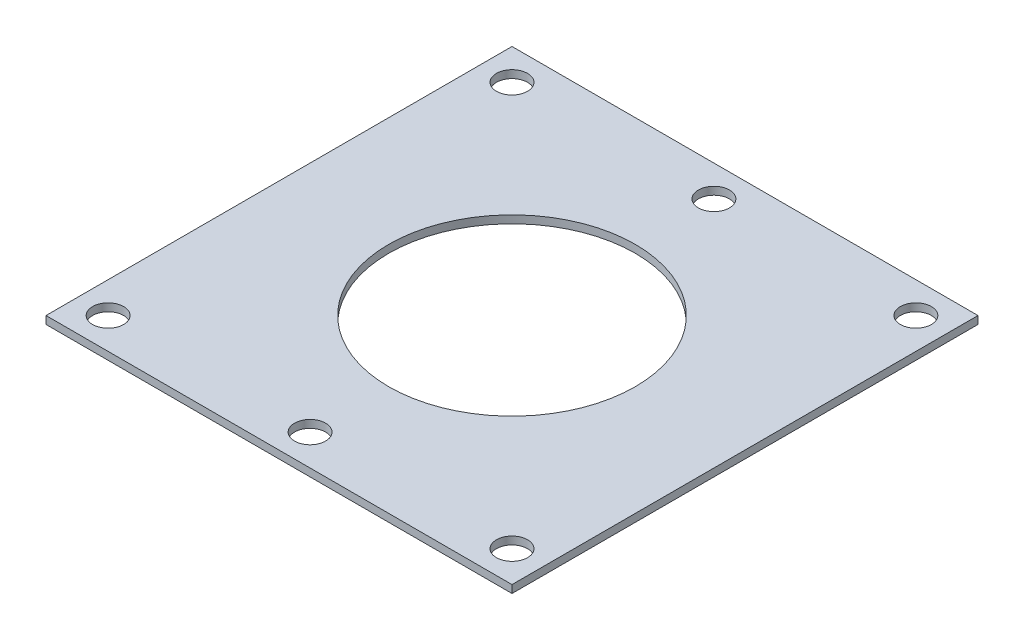
ISO-10303-21;
HEADER;
FILE_DESCRIPTION(('STEP AP214'),'2;1');
FILE_NAME('part.step','',(''),(''),'','','');
FILE_SCHEMA(('AUTOMOTIVE_DESIGN { 1 0 10303 214 1 1 1 1 }'));
ENDSEC;
DATA;
#1=APPLICATION_CONTEXT('core data for automotive mechanical design processes');
#2=APPLICATION_PROTOCOL_DEFINITION('international standard','automotive_design',2000,#1);
#3=PRODUCT_CONTEXT('',#1,'mechanical');
#4=PRODUCT('Part','Part','',(#3));
#5=PRODUCT_RELATED_PRODUCT_CATEGORY('part','',(#4));
#6=PRODUCT_DEFINITION_FORMATION('','',#4);
#7=PRODUCT_DEFINITION_CONTEXT('part definition',#1,'design');
#8=PRODUCT_DEFINITION('design','',#6,#7);
#9=PRODUCT_DEFINITION_SHAPE('','',#8);
#10=(LENGTH_UNIT() NAMED_UNIT(*) SI_UNIT(.MILLI.,.METRE.));
#11=(NAMED_UNIT(*) PLANE_ANGLE_UNIT() SI_UNIT($,.RADIAN.));
#12=(NAMED_UNIT(*) SI_UNIT($,.STERADIAN.) SOLID_ANGLE_UNIT());
#13=UNCERTAINTY_MEASURE_WITH_UNIT(LENGTH_MEASURE(1.E-05),#10,'distance_accuracy_value','');
#14=(GEOMETRIC_REPRESENTATION_CONTEXT(3) GLOBAL_UNCERTAINTY_ASSIGNED_CONTEXT((#13)) GLOBAL_UNIT_ASSIGNED_CONTEXT((#10,
#11,#12)) REPRESENTATION_CONTEXT('',''));
#15=CARTESIAN_POINT('',(0.,0.,0.));
#16=DIRECTION('',(0.,0.,1.));
#17=DIRECTION('',(1.,0.,0.));
#18=AXIS2_PLACEMENT_3D('',#15,#16,#17);
#19=CARTESIAN_POINT('',(-30.,1.,30.));
#20=DIRECTION('',(1.,0.,0.));
#21=DIRECTION('',(0.,0.,-1.));
#22=AXIS2_PLACEMENT_3D('',#19,#20,#21);
#23=PLANE('',#22);
#24=DIRECTION('',(0.,0.,1.));
#25=VECTOR('',#24,1.);
#26=CARTESIAN_POINT('',(-30.,0.,30.));
#27=LINE('',#26,#25);
#28=CARTESIAN_POINT('',(-30.,0.,-30.));
#29=VERTEX_POINT('',#28);
#30=CARTESIAN_POINT('',(-30.,0.,30.));
#31=VERTEX_POINT('',#30);
#32=EDGE_CURVE('E98',#29,#31,#27,.T.);
#33=ORIENTED_EDGE('',*,*,#32,.T.);
#34=DIRECTION('',(0.,-1.,0.));
#35=VECTOR('',#34,1.);
#36=CARTESIAN_POINT('',(-30.,1.,30.));
#37=LINE('',#36,#35);
#38=CARTESIAN_POINT('',(-30.,1.,30.));
#39=VERTEX_POINT('',#38);
#40=EDGE_CURVE('E11',#39,#31,#37,.T.);
#41=ORIENTED_EDGE('',*,*,#40,.F.);
#42=DIRECTION('',(0.,0.,1.));
#43=VECTOR('',#42,1.);
#44=CARTESIAN_POINT('',(-30.,1.,30.));
#45=LINE('',#44,#43);
#46=CARTESIAN_POINT('',(-30.,1.,-30.));
#47=VERTEX_POINT('',#46);
#48=EDGE_CURVE('E85',#47,#39,#45,.T.);
#49=ORIENTED_EDGE('',*,*,#48,.F.);
#50=DIRECTION('',(0.,-1.,0.));
#51=VECTOR('',#50,1.);
#52=CARTESIAN_POINT('',(-30.,1.,-30.));
#53=LINE('',#52,#51);
#54=EDGE_CURVE('E94',#47,#29,#53,.T.);
#55=ORIENTED_EDGE('',*,*,#54,.T.);
#56=EDGE_LOOP('',(#33,#41,#49,#55));
#57=FACE_BOUND('',#56,.T.);
#58=ADVANCED_FACE('F33',(#57),#23,.F.);
#59=CARTESIAN_POINT('',(30.,1.,30.));
#60=DIRECTION('',(0.,0.,-1.));
#61=DIRECTION('',(-1.,0.,0.));
#62=AXIS2_PLACEMENT_3D('',#59,#60,#61);
#63=PLANE('',#62);
#64=DIRECTION('',(1.,0.,0.));
#65=VECTOR('',#64,1.);
#66=CARTESIAN_POINT('',(30.,0.,30.));
#67=LINE('',#66,#65);
#68=CARTESIAN_POINT('',(30.,0.,30.));
#69=VERTEX_POINT('',#68);
#70=EDGE_CURVE('E89',#31,#69,#67,.T.);
#71=ORIENTED_EDGE('',*,*,#70,.T.);
#72=DIRECTION('',(0.,-1.,0.));
#73=VECTOR('',#72,1.);
#74=CARTESIAN_POINT('',(30.,1.,30.));
#75=LINE('',#74,#73);
#76=CARTESIAN_POINT('',(30.,1.,30.));
#77=VERTEX_POINT('',#76);
#78=EDGE_CURVE('E42',#77,#69,#75,.T.);
#79=ORIENTED_EDGE('',*,*,#78,.F.);
#80=DIRECTION('',(1.,0.,0.));
#81=VECTOR('',#80,1.);
#82=CARTESIAN_POINT('',(30.,1.,30.));
#83=LINE('',#82,#81);
#84=EDGE_CURVE('E80',#39,#77,#83,.T.);
#85=ORIENTED_EDGE('',*,*,#84,.F.);
#86=ORIENTED_EDGE('',*,*,#40,.T.);
#87=EDGE_LOOP('',(#71,#79,#85,#86));
#88=FACE_BOUND('',#87,.T.);
#89=ADVANCED_FACE('F88',(#88),#63,.F.);
#90=CARTESIAN_POINT('',(30.,1.,30.));
#91=DIRECTION('',(-1.,0.,0.));
#92=DIRECTION('',(0.,0.,1.));
#93=AXIS2_PLACEMENT_3D('',#90,#91,#92);
#94=PLANE('',#93);
#95=DIRECTION('',(0.,0.,-1.));
#96=VECTOR('',#95,1.);
#97=CARTESIAN_POINT('',(30.,0.,30.));
#98=LINE('',#97,#96);
#99=CARTESIAN_POINT('',(30.,0.,-30.));
#100=VERTEX_POINT('',#99);
#101=EDGE_CURVE('E67',#69,#100,#98,.T.);
#102=ORIENTED_EDGE('',*,*,#101,.T.);
#103=DIRECTION('',(0.,-1.,0.));
#104=VECTOR('',#103,1.);
#105=CARTESIAN_POINT('',(30.,1.,-30.));
#106=LINE('',#105,#104);
#107=CARTESIAN_POINT('',(30.,1.,-30.));
#108=VERTEX_POINT('',#107);
#109=EDGE_CURVE('E90',#108,#100,#106,.T.);
#110=ORIENTED_EDGE('',*,*,#109,.F.);
#111=DIRECTION('',(0.,0.,-1.));
#112=VECTOR('',#111,1.);
#113=CARTESIAN_POINT('',(30.,1.,30.));
#114=LINE('',#113,#112);
#115=EDGE_CURVE('E83',#77,#108,#114,.T.);
#116=ORIENTED_EDGE('',*,*,#115,.F.);
#117=ORIENTED_EDGE('',*,*,#78,.T.);
#118=EDGE_LOOP('',(#102,#110,#116,#117));
#119=FACE_BOUND('',#118,.T.);
#120=ADVANCED_FACE('F92',(#119),#94,.F.);
#121=CARTESIAN_POINT('',(30.,1.,-30.));
#122=DIRECTION('',(0.,0.,1.));
#123=DIRECTION('',(1.,0.,0.));
#124=AXIS2_PLACEMENT_3D('',#121,#122,#123);
#125=PLANE('',#124);
#126=DIRECTION('',(-1.,0.,0.));
#127=VECTOR('',#126,1.);
#128=CARTESIAN_POINT('',(30.,0.,-30.));
#129=LINE('',#128,#127);
#130=EDGE_CURVE('E73',#100,#29,#129,.T.);
#131=ORIENTED_EDGE('',*,*,#130,.T.);
#132=ORIENTED_EDGE('',*,*,#54,.F.);
#133=DIRECTION('',(-1.,0.,0.));
#134=VECTOR('',#133,1.);
#135=CARTESIAN_POINT('',(30.,1.,-30.));
#136=LINE('',#135,#134);
#137=EDGE_CURVE('E50',#108,#47,#136,.T.);
#138=ORIENTED_EDGE('',*,*,#137,.F.);
#139=ORIENTED_EDGE('',*,*,#109,.T.);
#140=EDGE_LOOP('',(#131,#132,#138,#139));
#141=FACE_BOUND('',#140,.T.);
#142=ADVANCED_FACE('F106',(#141),#125,.F.);
#143=CARTESIAN_POINT('',(0.,1.,0.));
#144=DIRECTION('',(0.,1.,0.));
#145=DIRECTION('',(0.,0.,1.));
#146=AXIS2_PLACEMENT_3D('',#143,#144,#145);
#147=PLANE('',#146);
#148=CARTESIAN_POINT('',(0.,1.,0.));
#149=DIRECTION('',(0.,1.,0.));
#150=DIRECTION('',(0.,0.,1.));
#151=AXIS2_PLACEMENT_3D('',#148,#149,#150);
#152=CIRCLE('',#151,15.875);
#153=CARTESIAN_POINT('',(0.,1.,15.875));
#154=VERTEX_POINT('',#153);
#155=EDGE_CURVE('E147',#154,#154,#152,.T.);
#156=ORIENTED_EDGE('',*,*,#155,.F.);
#157=EDGE_LOOP('',(#156));
#158=FACE_BOUND('',#157,.T.);
#159=CARTESIAN_POINT('',(-26.,1.,26.));
#160=DIRECTION('',(0.,1.,0.));
#161=DIRECTION('',(0.,0.,1.));
#162=AXIS2_PLACEMENT_3D('',#159,#160,#161);
#163=CIRCLE('',#162,2.);
#164=CARTESIAN_POINT('',(-26.,1.,28.));
#165=VERTEX_POINT('',#164);
#166=EDGE_CURVE('E142',#165,#165,#163,.T.);
#167=ORIENTED_EDGE('',*,*,#166,.F.);
#168=EDGE_LOOP('',(#167));
#169=FACE_BOUND('',#168,.T.);
#170=CARTESIAN_POINT('',(0.,1.,26.));
#171=DIRECTION('',(0.,1.,0.));
#172=DIRECTION('',(0.,0.,1.));
#173=AXIS2_PLACEMENT_3D('',#170,#171,#172);
#174=CIRCLE('',#173,2.);
#175=CARTESIAN_POINT('',(0.,1.,28.));
#176=VERTEX_POINT('',#175);
#177=EDGE_CURVE('E136',#176,#176,#174,.T.);
#178=ORIENTED_EDGE('',*,*,#177,.F.);
#179=EDGE_LOOP('',(#178));
#180=FACE_BOUND('',#179,.T.);
#181=CARTESIAN_POINT('',(26.,1.,26.));
#182=DIRECTION('',(0.,1.,0.));
#183=DIRECTION('',(0.,0.,1.));
#184=AXIS2_PLACEMENT_3D('',#181,#182,#183);
#185=CIRCLE('',#184,2.);
#186=CARTESIAN_POINT('',(26.,1.,28.));
#187=VERTEX_POINT('',#186);
#188=EDGE_CURVE('E130',#187,#187,#185,.T.);
#189=ORIENTED_EDGE('',*,*,#188,.F.);
#190=EDGE_LOOP('',(#189));
#191=FACE_BOUND('',#190,.T.);
#192=CARTESIAN_POINT('',(26.,1.,-26.));
#193=DIRECTION('',(0.,1.,0.));
#194=DIRECTION('',(0.,0.,1.));
#195=AXIS2_PLACEMENT_3D('',#192,#193,#194);
#196=CIRCLE('',#195,2.);
#197=CARTESIAN_POINT('',(26.,1.,-24.));
#198=VERTEX_POINT('',#197);
#199=EDGE_CURVE('E124',#198,#198,#196,.T.);
#200=ORIENTED_EDGE('',*,*,#199,.F.);
#201=EDGE_LOOP('',(#200));
#202=FACE_BOUND('',#201,.T.);
#203=CARTESIAN_POINT('',(0.,1.,-26.));
#204=DIRECTION('',(0.,1.,0.));
#205=DIRECTION('',(0.,0.,1.));
#206=AXIS2_PLACEMENT_3D('',#203,#204,#205);
#207=CIRCLE('',#206,2.);
#208=CARTESIAN_POINT('',(0.,1.,-24.));
#209=VERTEX_POINT('',#208);
#210=EDGE_CURVE('E118',#209,#209,#207,.T.);
#211=ORIENTED_EDGE('',*,*,#210,.F.);
#212=EDGE_LOOP('',(#211));
#213=FACE_BOUND('',#212,.T.);
#214=CARTESIAN_POINT('',(-26.,1.,-26.));
#215=DIRECTION('',(0.,1.,0.));
#216=DIRECTION('',(0.,0.,1.));
#217=AXIS2_PLACEMENT_3D('',#214,#215,#216);
#218=CIRCLE('',#217,2.);
#219=CARTESIAN_POINT('',(-26.,1.,-24.));
#220=VERTEX_POINT('',#219);
#221=EDGE_CURVE('E112',#220,#220,#218,.T.);
#222=ORIENTED_EDGE('',*,*,#221,.F.);
#223=EDGE_LOOP('',(#222));
#224=FACE_BOUND('',#223,.T.);
#225=ORIENTED_EDGE('',*,*,#48,.T.);
#226=ORIENTED_EDGE('',*,*,#84,.T.);
#227=ORIENTED_EDGE('',*,*,#115,.T.);
#228=ORIENTED_EDGE('',*,*,#137,.T.);
#229=EDGE_LOOP('',(#225,#226,#227,#228));
#230=FACE_BOUND('',#229,.T.);
#231=ADVANCED_FACE('F81',(#158,#169,#180,#191,#202,#213,#224,#230),#147,.T.);
#232=CARTESIAN_POINT('',(0.,0.,0.));
#233=DIRECTION('',(0.,1.,0.));
#234=DIRECTION('',(0.,0.,1.));
#235=AXIS2_PLACEMENT_3D('',#232,#233,#234);
#236=PLANE('',#235);
#237=CARTESIAN_POINT('',(0.,0.,0.));
#238=DIRECTION('',(0.,1.,0.));
#239=DIRECTION('',(0.,0.,1.));
#240=AXIS2_PLACEMENT_3D('',#237,#238,#239);
#241=CIRCLE('',#240,15.875);
#242=CARTESIAN_POINT('',(0.,0.,15.875));
#243=VERTEX_POINT('',#242);
#244=EDGE_CURVE('E36',#243,#243,#241,.T.);
#245=ORIENTED_EDGE('',*,*,#244,.T.);
#246=EDGE_LOOP('',(#245));
#247=FACE_BOUND('',#246,.T.);
#248=CARTESIAN_POINT('',(-26.,0.,26.));
#249=DIRECTION('',(0.,1.,0.));
#250=DIRECTION('',(0.,0.,1.));
#251=AXIS2_PLACEMENT_3D('',#248,#249,#250);
#252=CIRCLE('',#251,2.);
#253=CARTESIAN_POINT('',(-26.,0.,28.));
#254=VERTEX_POINT('',#253);
#255=EDGE_CURVE('E139',#254,#254,#252,.T.);
#256=ORIENTED_EDGE('',*,*,#255,.T.);
#257=EDGE_LOOP('',(#256));
#258=FACE_BOUND('',#257,.T.);
#259=CARTESIAN_POINT('',(0.,0.,26.));
#260=DIRECTION('',(0.,1.,0.));
#261=DIRECTION('',(0.,0.,1.));
#262=AXIS2_PLACEMENT_3D('',#259,#260,#261);
#263=CIRCLE('',#262,2.);
#264=CARTESIAN_POINT('',(0.,0.,28.));
#265=VERTEX_POINT('',#264);
#266=EDGE_CURVE('E133',#265,#265,#263,.T.);
#267=ORIENTED_EDGE('',*,*,#266,.T.);
#268=EDGE_LOOP('',(#267));
#269=FACE_BOUND('',#268,.T.);
#270=CARTESIAN_POINT('',(26.,0.,26.));
#271=DIRECTION('',(0.,1.,0.));
#272=DIRECTION('',(0.,0.,1.));
#273=AXIS2_PLACEMENT_3D('',#270,#271,#272);
#274=CIRCLE('',#273,2.);
#275=CARTESIAN_POINT('',(26.,0.,28.));
#276=VERTEX_POINT('',#275);
#277=EDGE_CURVE('E127',#276,#276,#274,.T.);
#278=ORIENTED_EDGE('',*,*,#277,.T.);
#279=EDGE_LOOP('',(#278));
#280=FACE_BOUND('',#279,.T.);
#281=CARTESIAN_POINT('',(26.,0.,-26.));
#282=DIRECTION('',(0.,1.,0.));
#283=DIRECTION('',(0.,0.,1.));
#284=AXIS2_PLACEMENT_3D('',#281,#282,#283);
#285=CIRCLE('',#284,2.);
#286=CARTESIAN_POINT('',(26.,0.,-24.));
#287=VERTEX_POINT('',#286);
#288=EDGE_CURVE('E121',#287,#287,#285,.T.);
#289=ORIENTED_EDGE('',*,*,#288,.T.);
#290=EDGE_LOOP('',(#289));
#291=FACE_BOUND('',#290,.T.);
#292=CARTESIAN_POINT('',(0.,0.,-26.));
#293=DIRECTION('',(0.,1.,0.));
#294=DIRECTION('',(0.,0.,1.));
#295=AXIS2_PLACEMENT_3D('',#292,#293,#294);
#296=CIRCLE('',#295,2.);
#297=CARTESIAN_POINT('',(0.,0.,-24.));
#298=VERTEX_POINT('',#297);
#299=EDGE_CURVE('E115',#298,#298,#296,.T.);
#300=ORIENTED_EDGE('',*,*,#299,.T.);
#301=EDGE_LOOP('',(#300));
#302=FACE_BOUND('',#301,.T.);
#303=CARTESIAN_POINT('',(-26.,0.,-26.));
#304=DIRECTION('',(0.,1.,0.));
#305=DIRECTION('',(0.,0.,1.));
#306=AXIS2_PLACEMENT_3D('',#303,#304,#305);
#307=CIRCLE('',#306,2.);
#308=CARTESIAN_POINT('',(-26.,0.,-24.));
#309=VERTEX_POINT('',#308);
#310=EDGE_CURVE('E101',#309,#309,#307,.T.);
#311=ORIENTED_EDGE('',*,*,#310,.T.);
#312=EDGE_LOOP('',(#311));
#313=FACE_BOUND('',#312,.T.);
#314=ORIENTED_EDGE('',*,*,#32,.F.);
#315=ORIENTED_EDGE('',*,*,#130,.F.);
#316=ORIENTED_EDGE('',*,*,#101,.F.);
#317=ORIENTED_EDGE('',*,*,#70,.F.);
#318=EDGE_LOOP('',(#314,#315,#316,#317));
#319=FACE_BOUND('',#318,.T.);
#320=ADVANCED_FACE('F109',(#247,#258,#269,#280,#291,#302,#313,#319),#236,.F.);
#321=CARTESIAN_POINT('',(-26.,0.,-26.));
#322=DIRECTION('',(0.,1.,0.));
#323=DIRECTION('',(0.,0.,1.));
#324=AXIS2_PLACEMENT_3D('',#321,#322,#323);
#325=CYLINDRICAL_SURFACE('',#324,2.);
#326=ORIENTED_EDGE('',*,*,#310,.F.);
#327=EDGE_LOOP('',(#326));
#328=FACE_BOUND('',#327,.T.);
#329=ORIENTED_EDGE('',*,*,#221,.T.);
#330=EDGE_LOOP('',(#329));
#331=FACE_BOUND('',#330,.T.);
#332=ADVANCED_FACE('F179',(#328,#331),#325,.F.);
#333=CARTESIAN_POINT('',(0.,0.,-26.));
#334=DIRECTION('',(0.,1.,0.));
#335=DIRECTION('',(0.,0.,1.));
#336=AXIS2_PLACEMENT_3D('',#333,#334,#335);
#337=CYLINDRICAL_SURFACE('',#336,2.);
#338=ORIENTED_EDGE('',*,*,#299,.F.);
#339=EDGE_LOOP('',(#338));
#340=FACE_BOUND('',#339,.T.);
#341=ORIENTED_EDGE('',*,*,#210,.T.);
#342=EDGE_LOOP('',(#341));
#343=FACE_BOUND('',#342,.T.);
#344=ADVANCED_FACE('F185',(#340,#343),#337,.F.);
#345=CARTESIAN_POINT('',(26.,0.,-26.));
#346=DIRECTION('',(0.,1.,0.));
#347=DIRECTION('',(0.,0.,1.));
#348=AXIS2_PLACEMENT_3D('',#345,#346,#347);
#349=CYLINDRICAL_SURFACE('',#348,2.);
#350=ORIENTED_EDGE('',*,*,#288,.F.);
#351=EDGE_LOOP('',(#350));
#352=FACE_BOUND('',#351,.T.);
#353=ORIENTED_EDGE('',*,*,#199,.T.);
#354=EDGE_LOOP('',(#353));
#355=FACE_BOUND('',#354,.T.);
#356=ADVANCED_FACE('F189',(#352,#355),#349,.F.);
#357=CARTESIAN_POINT('',(26.,0.,26.));
#358=DIRECTION('',(0.,1.,0.));
#359=DIRECTION('',(0.,0.,1.));
#360=AXIS2_PLACEMENT_3D('',#357,#358,#359);
#361=CYLINDRICAL_SURFACE('',#360,2.);
#362=ORIENTED_EDGE('',*,*,#277,.F.);
#363=EDGE_LOOP('',(#362));
#364=FACE_BOUND('',#363,.T.);
#365=ORIENTED_EDGE('',*,*,#188,.T.);
#366=EDGE_LOOP('',(#365));
#367=FACE_BOUND('',#366,.T.);
#368=ADVANCED_FACE('F193',(#364,#367),#361,.F.);
#369=CARTESIAN_POINT('',(0.,0.,26.));
#370=DIRECTION('',(0.,1.,0.));
#371=DIRECTION('',(0.,0.,1.));
#372=AXIS2_PLACEMENT_3D('',#369,#370,#371);
#373=CYLINDRICAL_SURFACE('',#372,2.);
#374=ORIENTED_EDGE('',*,*,#266,.F.);
#375=EDGE_LOOP('',(#374));
#376=FACE_BOUND('',#375,.T.);
#377=ORIENTED_EDGE('',*,*,#177,.T.);
#378=EDGE_LOOP('',(#377));
#379=FACE_BOUND('',#378,.T.);
#380=ADVANCED_FACE('F163',(#376,#379),#373,.F.);
#381=CARTESIAN_POINT('',(-26.,0.,26.));
#382=DIRECTION('',(0.,1.,0.));
#383=DIRECTION('',(0.,0.,1.));
#384=AXIS2_PLACEMENT_3D('',#381,#382,#383);
#385=CYLINDRICAL_SURFACE('',#384,2.);
#386=ORIENTED_EDGE('',*,*,#255,.F.);
#387=EDGE_LOOP('',(#386));
#388=FACE_BOUND('',#387,.T.);
#389=ORIENTED_EDGE('',*,*,#166,.T.);
#390=EDGE_LOOP('',(#389));
#391=FACE_BOUND('',#390,.T.);
#392=ADVANCED_FACE('F158',(#388,#391),#385,.F.);
#393=CARTESIAN_POINT('',(0.,-9.,0.));
#394=DIRECTION('',(0.,1.,0.));
#395=DIRECTION('',(0.,0.,1.));
#396=AXIS2_PLACEMENT_3D('',#393,#394,#395);
#397=CYLINDRICAL_SURFACE('',#396,15.875);
#398=ORIENTED_EDGE('',*,*,#155,.T.);
#399=EDGE_LOOP('',(#398));
#400=FACE_BOUND('',#399,.T.);
#401=ORIENTED_EDGE('',*,*,#244,.F.);
#402=EDGE_LOOP('',(#401));
#403=FACE_BOUND('',#402,.T.);
#404=ADVANCED_FACE('F156',(#400,#403),#397,.F.);
#405=CLOSED_SHELL('',(#58,#89,#120,#142,#231,#320,#332,#344,#356,#368,#380,#392,#404));
#406=MANIFOLD_SOLID_BREP('B2',#405);
#407=ADVANCED_BREP_SHAPE_REPRESENTATION('',(#18,#406),#14);
#408=SHAPE_DEFINITION_REPRESENTATION(#9,#407);
ENDSEC;
END-ISO-10303-21;
